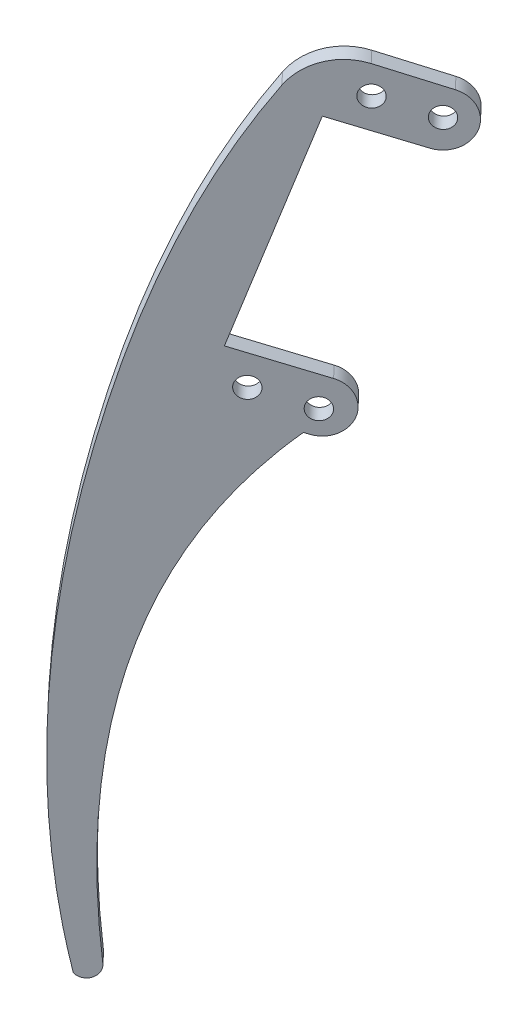
ISO-10303-21;
HEADER;
FILE_DESCRIPTION(('STEP AP214'),'2;1');
FILE_NAME('part.step','',(''),(''),'','','');
FILE_SCHEMA(('AUTOMOTIVE_DESIGN { 1 0 10303 214 1 1 1 1 }'));
ENDSEC;
DATA;
#1=APPLICATION_CONTEXT('core data for automotive mechanical design processes');
#2=APPLICATION_PROTOCOL_DEFINITION('international standard','automotive_design',2000,#1);
#3=PRODUCT_CONTEXT('',#1,'mechanical');
#4=PRODUCT('Part','Part','',(#3));
#5=PRODUCT_RELATED_PRODUCT_CATEGORY('part','',(#4));
#6=PRODUCT_DEFINITION_FORMATION('','',#4);
#7=PRODUCT_DEFINITION_CONTEXT('part definition',#1,'design');
#8=PRODUCT_DEFINITION('design','',#6,#7);
#9=PRODUCT_DEFINITION_SHAPE('','',#8);
#10=(LENGTH_UNIT() NAMED_UNIT(*) SI_UNIT(.MILLI.,.METRE.));
#11=(NAMED_UNIT(*) PLANE_ANGLE_UNIT() SI_UNIT($,.RADIAN.));
#12=(NAMED_UNIT(*) SI_UNIT($,.STERADIAN.) SOLID_ANGLE_UNIT());
#13=UNCERTAINTY_MEASURE_WITH_UNIT(LENGTH_MEASURE(1.E-05),#10,'distance_accuracy_value','');
#14=(GEOMETRIC_REPRESENTATION_CONTEXT(3) GLOBAL_UNCERTAINTY_ASSIGNED_CONTEXT((#13)) GLOBAL_UNIT_ASSIGNED_CONTEXT((#10,
#11,#12)) REPRESENTATION_CONTEXT('',''));
#15=CARTESIAN_POINT('',(0.,0.,0.));
#16=DIRECTION('',(0.,0.,1.));
#17=DIRECTION('',(1.,0.,0.));
#18=AXIS2_PLACEMENT_3D('',#15,#16,#17);
#19=CARTESIAN_POINT('',(-156.350347248188,53.1352398100801,110.507053501825));
#20=DIRECTION('',(-0.687588527999233,0.,-0.726100555132585));
#21=DIRECTION('',(-0.726100555132585,0.,0.687588527999233));
#22=AXIS2_PLACEMENT_3D('',#19,#20,#21);
#23=CYLINDRICAL_SURFACE('',#22,4.71761508586367);
#24=DIRECTION('',(0.687588527999233,0.,0.726100555132585));
#25=VECTOR('',#24,1.);
#26=CARTESIAN_POINT('',(-155.23061358615,57.5936879973342,109.446709979169));
#27=LINE('',#26,#25);
#28=CARTESIAN_POINT('',(-155.23061358615,57.5936879973342,109.446709979169));
#29=VERTEX_POINT('',#28);
#30=CARTESIAN_POINT('',(-157.293379170147,57.5936879973342,107.268408313772));
#31=VERTEX_POINT('',#30);
#32=EDGE_CURVE('E126',#29,#31,#27,.F.);
#33=ORIENTED_EDGE('',*,*,#32,.F.);
#34=CARTESIAN_POINT('',(-156.350347248188,53.1352398100801,110.507053501825));
#35=DIRECTION('',(-0.687588527999232,0.,-0.726100555132586));
#36=DIRECTION('',(-0.726100555132586,0.,0.687588527999232));
#37=AXIS2_PLACEMENT_3D('',#34,#35,#36);
#38=CIRCLE('',#37,4.71761508586367);
#39=CARTESIAN_POINT('',(-157.470080910226,48.6767916228261,111.567397024481));
#40=VERTEX_POINT('',#39);
#41=EDGE_CURVE('E47',#40,#29,#38,.F.);
#42=ORIENTED_EDGE('',*,*,#41,.F.);
#43=DIRECTION('',(-0.687588527999233,0.,-0.726100555132585));
#44=VECTOR('',#43,1.);
#45=CARTESIAN_POINT('',(-159.532846494223,48.6767916228261,109.389095359083));
#46=LINE('',#45,#44);
#47=CARTESIAN_POINT('',(-159.532846494223,48.6767916228261,109.389095359083));
#48=VERTEX_POINT('',#47);
#49=EDGE_CURVE('E269',#48,#40,#46,.F.);
#50=ORIENTED_EDGE('',*,*,#49,.F.);
#51=CARTESIAN_POINT('',(-158.413112832185,53.1352398100802,108.328751836427));
#52=DIRECTION('',(-0.687588527999232,0.,-0.726100555132586));
#53=DIRECTION('',(-0.726100555132586,0.,0.687588527999232));
#54=AXIS2_PLACEMENT_3D('',#51,#52,#53);
#55=CIRCLE('',#54,4.71761508586367);
#56=EDGE_CURVE('E12',#31,#48,#55,.T.);
#57=ORIENTED_EDGE('',*,*,#56,.F.);
#58=EDGE_LOOP('',(#33,#42,#50,#57));
#59=FACE_BOUND('',#58,.T.);
#60=ADVANCED_FACE('F39',(#59),#23,.T.);
#61=CARTESIAN_POINT('',(-145.004680858314,99.0307376649446,99.7631558459979));
#62=DIRECTION('',(0.687588527999233,0.,0.726100555132585));
#63=DIRECTION('',(0.726100555132585,0.,-0.687588527999233));
#64=AXIS2_PLACEMENT_3D('',#61,#62,#63);
#65=CYLINDRICAL_SURFACE('',#64,4.95310679918581);
#66=DIRECTION('',(0.687588527999233,0.,0.726100555132585));
#67=VECTOR('',#66,1.);
#68=CARTESIAN_POINT('',(-145.845721127589,103.689297249869,96.4279285938738));
#69=LINE('',#68,#67);
#70=CARTESIAN_POINT('',(-143.782955543592,103.689297249868,98.6062302592716));
#71=VERTEX_POINT('',#70);
#72=CARTESIAN_POINT('',(-145.845721127589,103.689297249869,96.4279285938738));
#73=VERTEX_POINT('',#72);
#74=EDGE_CURVE('E195',#71,#73,#69,.F.);
#75=ORIENTED_EDGE('',*,*,#74,.F.);
#76=CARTESIAN_POINT('',(-145.004680858314,99.0307376649446,99.7631558459979));
#77=DIRECTION('',(-0.687588527999232,0.,-0.726100555132586));
#78=DIRECTION('',(-0.726100555132586,0.,0.687588527999232));
#79=AXIS2_PLACEMENT_3D('',#76,#77,#78);
#80=CIRCLE('',#79,4.95310679918581);
#81=CARTESIAN_POINT('',(-146.180308863942,94.3497347369444,100.876429102919));
#82=VERTEX_POINT('',#81);
#83=EDGE_CURVE('E198',#82,#71,#80,.F.);
#84=ORIENTED_EDGE('',*,*,#83,.F.);
#85=DIRECTION('',(-0.687588527999233,0.,-0.726100555132585));
#86=VECTOR('',#85,1.);
#87=CARTESIAN_POINT('',(-146.180308863942,94.3497347369444,100.876429102919));
#88=LINE('',#87,#86);
#89=CARTESIAN_POINT('',(-148.24307444794,94.3497347369444,98.6981274375217));
#90=VERTEX_POINT('',#89);
#91=EDGE_CURVE('E202',#90,#82,#88,.F.);
#92=ORIENTED_EDGE('',*,*,#91,.F.);
#93=CARTESIAN_POINT('',(-147.067446442311,99.0307376649446,97.5848541806001));
#94=DIRECTION('',(-0.687588527999232,0.,-0.726100555132586));
#95=DIRECTION('',(-0.726100555132586,0.,0.687588527999232));
#96=AXIS2_PLACEMENT_3D('',#93,#94,#95);
#97=CIRCLE('',#96,4.95310679918581);
#98=EDGE_CURVE('E200',#73,#90,#97,.T.);
#99=ORIENTED_EDGE('',*,*,#98,.F.);
#100=EDGE_LOOP('',(#75,#84,#92,#99));
#101=FACE_BOUND('',#100,.T.);
#102=ADVANCED_FACE('F183',(#101),#65,.T.);
#103=CARTESIAN_POINT('',(-154.162654944035,98.2201573974446,108.435395354073));
#104=DIRECTION('',(0.687588527999233,0.,0.726100555132585));
#105=DIRECTION('',(0.726100555132585,0.,-0.687588527999233));
#106=AXIS2_PLACEMENT_3D('',#103,#104,#105);
#107=CYLINDRICAL_SURFACE('',#106,10.);
#108=DIRECTION('',(0.687588527999233,0.,0.726100555132585));
#109=VECTOR('',#108,1.);
#110=CARTESIAN_POINT('',(-160.093495987517,103.989265875256,114.051667417301));
#111=LINE('',#110,#109);
#112=CARTESIAN_POINT('',(-160.093495987518,103.989265875255,114.051667417302));
#113=VERTEX_POINT('',#112);
#114=CARTESIAN_POINT('',(-162.156261571515,103.989265875256,111.873365751904));
#115=VERTEX_POINT('',#114);
#116=EDGE_CURVE('E241',#113,#115,#111,.F.);
#117=ORIENTED_EDGE('',*,*,#116,.F.);
#118=CARTESIAN_POINT('',(-154.162654944035,98.2201573974446,108.435395354073));
#119=DIRECTION('',(-0.687588527999232,0.,-0.726100555132586));
#120=DIRECTION('',(-0.726100555132586,0.,0.687588527999232));
#121=AXIS2_PLACEMENT_3D('',#118,#119,#120);
#122=CIRCLE('',#121,10.);
#123=CARTESIAN_POINT('',(-151.696071112403,107.625485757596,106.099637952443));
#124=VERTEX_POINT('',#123);
#125=EDGE_CURVE('E261',#124,#113,#122,.F.);
#126=ORIENTED_EDGE('',*,*,#125,.F.);
#127=DIRECTION('',(0.687588527999233,0.,0.726100555132585));
#128=VECTOR('',#127,1.);
#129=CARTESIAN_POINT('',(-153.7588366964,107.625485757596,103.921336287045));
#130=LINE('',#129,#128);
#131=CARTESIAN_POINT('',(-153.7588366964,107.625485757596,103.921336287045));
#132=VERTEX_POINT('',#131);
#133=EDGE_CURVE('E208',#132,#124,#130,.T.);
#134=ORIENTED_EDGE('',*,*,#133,.F.);
#135=CARTESIAN_POINT('',(-156.225420528033,98.2201573974446,106.257093688676));
#136=DIRECTION('',(-0.687588527999232,0.,-0.726100555132586));
#137=DIRECTION('',(-0.726100555132586,0.,0.687588527999232));
#138=AXIS2_PLACEMENT_3D('',#135,#136,#137);
#139=CIRCLE('',#138,10.);
#140=EDGE_CURVE('E203',#115,#132,#139,.T.);
#141=ORIENTED_EDGE('',*,*,#140,.F.);
#142=EDGE_LOOP('',(#117,#126,#134,#141));
#143=FACE_BOUND('',#142,.T.);
#144=ADVANCED_FACE('F181',(#143),#107,.T.);
#145=CARTESIAN_POINT('',(-178.91344157564,39.3494428640082,131.873412067531));
#146=DIRECTION('',(-0.687588527999232,0.,-0.726100555132586));
#147=DIRECTION('',(-0.726100555132586,0.,0.687588527999232));
#148=AXIS2_PLACEMENT_3D('',#145,#146,#147);
#149=PLANE('',#148);
#150=CARTESIAN_POINT('',(-151.666537072057,102.459409082074,106.071670383512));
#151=DIRECTION('',(0.687588527999233,0.,0.726100555132585));
#152=DIRECTION('',(0.726100555132585,0.,-0.687588527999233));
#153=AXIS2_PLACEMENT_3D('',#150,#151,#152);
#154=CIRCLE('',#153,1.90499999999996);
#155=CARTESIAN_POINT('',(-150.28331551453,102.459409082074,104.761814237674));
#156=VERTEX_POINT('',#155);
#157=EDGE_CURVE('E257',#156,#156,#154,.T.);
#158=ORIENTED_EDGE('',*,*,#157,.F.);
#159=EDGE_LOOP('',(#158));
#160=FACE_BOUND('',#159,.T.);
#161=CARTESIAN_POINT('',(-144.938645084473,99.2544943211719,99.7006225781071));
#162=DIRECTION('',(0.687588527999233,0.,0.726100555132585));
#163=DIRECTION('',(0.726100555132585,0.,-0.687588527999233));
#164=AXIS2_PLACEMENT_3D('',#161,#162,#163);
#165=CIRCLE('',#164,1.90499999999996);
#166=CARTESIAN_POINT('',(-143.555423526946,99.2544943211719,98.3907664322686));
#167=VERTEX_POINT('',#166);
#168=EDGE_CURVE('E245',#167,#167,#165,.T.);
#169=ORIENTED_EDGE('',*,*,#168,.F.);
#170=EDGE_LOOP('',(#169));
#171=FACE_BOUND('',#170,.T.);
#172=DIRECTION('',(0.686211495612596,-0.326885353606716,-0.649815165171247));
#173=VECTOR('',#172,1.);
#174=CARTESIAN_POINT('',(-158.068027168026,48.9616307360856,112.133628497956));
#175=LINE('',#174,#173);
#176=CARTESIAN_POINT('',(-158.068027168026,48.9616307360856,112.133628497956));
#177=VERTEX_POINT('',#176);
#178=EDGE_CURVE('E145',#177,#40,#175,.T.);
#179=ORIENTED_EDGE('',*,*,#178,.T.);
#180=ORIENTED_EDGE('',*,*,#41,.T.);
#181=DIRECTION('',(-0.686211495612596,0.326885353606716,0.649815165171248));
#182=VECTOR('',#181,1.);
#183=CARTESIAN_POINT('',(-172.290423852449,65.7203401257488,125.601676045555));
#184=LINE('',#183,#182);
#185=CARTESIAN_POINT('',(-165.501405173451,62.4863069075413,119.172743679294));
#186=VERTEX_POINT('',#185);
#187=EDGE_CURVE('E229',#29,#186,#184,.T.);
#188=ORIENTED_EDGE('',*,*,#187,.T.);
#189=DIRECTION('',(0.237351636718549,0.945064000794344,-0.224762619110949));
#190=VECTOR('',#189,1.);
#191=CARTESIAN_POINT('',(-172.124422896642,36.1154096458007,125.44447970127));
#192=LINE('',#191,#190);
#193=CARTESIAN_POINT('',(-156.28950333044,99.1653748551708,110.449436716455));
#194=VERTEX_POINT('',#193);
#195=EDGE_CURVE('E137',#186,#194,#192,.T.);
#196=ORIENTED_EDGE('',*,*,#195,.T.);
#197=DIRECTION('',(0.686211495612595,-0.326885353606717,-0.649815165171248));
#198=VECTOR('',#197,1.);
#199=CARTESIAN_POINT('',(-163.078522009438,102.399408073378,116.878369082716));
#200=LINE('',#199,#198);
#201=EDGE_CURVE('E238',#194,#82,#200,.T.);
#202=ORIENTED_EDGE('',*,*,#201,.T.);
#203=ORIENTED_EDGE('',*,*,#83,.T.);
#204=DIRECTION('',(-0.682921414350983,0.339702788297954,0.646699588250564));
#205=VECTOR('',#204,1.);
#206=CARTESIAN_POINT('',(-140.446048893136,102.029433509138,95.4463115460309));
#207=LINE('',#206,#205);
#208=EDGE_CURVE('E206',#71,#124,#207,.T.);
#209=ORIENTED_EDGE('',*,*,#208,.T.);
#210=ORIENTED_EDGE('',*,*,#125,.T.);
#211=CARTESIAN_POINT('',(-156.706471761986,110.117788730375,110.844289341264));
#212=CARTESIAN_POINT('',(-165.389464605852,95.5567781375464,119.066740386012));
#213=CARTESIAN_POINT('',(-171.354325872558,77.203961524337,124.715228256049));
#214=CARTESIAN_POINT('',(-182.015512379828,27.9424777058261,134.810950515785));
#215=CARTESIAN_POINT('',(-184.5509725595,-5.55144568956583,137.211931096806));
#216=CARTESIAN_POINT('',(-179.709395746549,-37.3051271876202,132.627149208841));
#217=B_SPLINE_CURVE_WITH_KNOTS('',3,(#211,#212,#213,#214,#215,#216),.UNSPECIFIED.,.F.,.F.,(4,2,
4),(0.20816836898779,0.5,1.),.UNSPECIFIED.);
#218=CARTESIAN_POINT('',(-179.709395746549,-37.3051271876202,132.627149208841));
#219=VERTEX_POINT('',#218);
#220=EDGE_CURVE('E211',#113,#219,#217,.T.);
#221=ORIENTED_EDGE('',*,*,#220,.T.);
#222=CARTESIAN_POINT('',(-178.494266452893,-35.9408966491913,131.47646979337));
#223=DIRECTION('',(0.687588527999233,0.,0.726100555132585));
#224=DIRECTION('',(0.726100555132585,0.,-0.687588527999233));
#225=AXIS2_PLACEMENT_3D('',#222,#223,#224);
#226=CIRCLE('',#225,2.15910335080896);
#227=CARTESIAN_POINT('',(-176.930693083653,-35.7838478574372,129.995827609894));
#228=VERTEX_POINT('',#227);
#229=EDGE_CURVE('E213',#219,#228,#226,.T.);
#230=ORIENTED_EDGE('',*,*,#229,.T.);
#231=CARTESIAN_POINT('',(586.336011271694,-821.148347771269,-592.787574783582));
#232=DIRECTION('',(-0.687588527999233,0.,-0.726100555132585));
#233=DIRECTION('',(0.557424393382231,-0.640814372215929,-0.527858869418671));
#234=AXIS2_PLACEMENT_3D('',#231,#232,#233);
#235=ELLIPSE('',#234,1345.47017903195,311.067485079547);
#236=EDGE_CURVE('E151',#228,#177,#235,.T.);
#237=ORIENTED_EDGE('',*,*,#236,.T.);
#238=EDGE_LOOP('',(#179,#180,#188,#196,#202,#203,#209,#210,#221,#230,#237));
#239=FACE_BOUND('',#238,.T.);
#240=CARTESIAN_POINT('',(-156.616298140698,52.7575344948903,110.758898485842));
#241=DIRECTION('',(0.687588527999233,0.,0.726100555132585));
#242=DIRECTION('',(0.726100555132585,0.,-0.687588527999233));
#243=AXIS2_PLACEMENT_3D('',#240,#241,#242);
#244=CIRCLE('',#243,1.90499999999997);
#245=CARTESIAN_POINT('',(-155.233076583171,52.7575344948903,109.449042340003));
#246=VERTEX_POINT('',#245);
#247=EDGE_CURVE('E249',#246,#246,#244,.T.);
#248=ORIENTED_EDGE('',*,*,#247,.F.);
#249=EDGE_LOOP('',(#248));
#250=FACE_BOUND('',#249,.T.);
#251=CARTESIAN_POINT('',(-163.344190128283,55.962449255792,117.129946291247));
#252=DIRECTION('',(0.687588527999233,0.,0.726100555132585));
#253=DIRECTION('',(0.726100555132585,0.,-0.687588527999233));
#254=AXIS2_PLACEMENT_3D('',#251,#252,#253);
#255=CIRCLE('',#254,1.90499999999997);
#256=CARTESIAN_POINT('',(-161.960968570755,55.962449255792,115.820090145408));
#257=VERTEX_POINT('',#256);
#258=EDGE_CURVE('E253',#257,#257,#255,.T.);
#259=ORIENTED_EDGE('',*,*,#258,.F.);
#260=EDGE_LOOP('',(#259));
#261=FACE_BOUND('',#260,.T.);
#262=ADVANCED_FACE('F179',(#160,#171,#239,#250,#261),#149,.F.);
#263=CARTESIAN_POINT('',(-160.130792752023,48.9616307360856,109.955326832558));
#264=DIRECTION('',(-0.237351636718549,-0.945064000794344,0.224762619110949));
#265=DIRECTION('',(0.969879782026592,-0.243584089004292,0.));
#266=AXIS2_PLACEMENT_3D('',#263,#264,#265);
#267=PLANE('',#266);
#268=DIRECTION('',(0.686211495612596,-0.326885353606716,-0.649815165171247));
#269=VECTOR('',#268,1.);
#270=CARTESIAN_POINT('',(-160.130792752023,48.9616307360856,109.955326832558));
#271=LINE('',#270,#269);
#272=CARTESIAN_POINT('',(-160.130792752023,48.9616307360856,109.955326832558));
#273=VERTEX_POINT('',#272);
#274=EDGE_CURVE('E147',#273,#48,#271,.T.);
#275=ORIENTED_EDGE('',*,*,#274,.T.);
#276=ORIENTED_EDGE('',*,*,#49,.T.);
#277=ORIENTED_EDGE('',*,*,#178,.F.);
#278=DIRECTION('',(0.687588527999233,0.,0.726100555132585));
#279=VECTOR('',#278,1.);
#280=CARTESIAN_POINT('',(-160.130792752023,48.9616307360856,109.955326832558));
#281=LINE('',#280,#279);
#282=EDGE_CURVE('E227',#273,#177,#281,.T.);
#283=ORIENTED_EDGE('',*,*,#282,.F.);
#284=EDGE_LOOP('',(#275,#276,#277,#283));
#285=FACE_BOUND('',#284,.T.);
#286=ADVANCED_FACE('F175',(#285),#267,.T.);
#287=CARTESIAN_POINT('',(584.273245687696,-821.148347771269,-594.965876448979));
#288=DIRECTION('',(-0.687588527999233,0.,-0.726100555132585));
#289=DIRECTION('',(0.557424393382231,-0.640814372215929,-0.527858869418671));
#290=AXIS2_PLACEMENT_3D('',#287,#288,#289);
#291=ELLIPSE('',#290,1345.47017903195,311.067485079547);
#292=DIRECTION('',(0.687588527999233,0.,0.726100555132585));
#293=VECTOR('',#292,1.);
#294=SURFACE_OF_LINEAR_EXTRUSION('',#291,#293);
#295=ORIENTED_EDGE('',*,*,#236,.F.);
#296=DIRECTION('',(0.687588527999233,0.,0.726100555132585));
#297=VECTOR('',#296,1.);
#298=CARTESIAN_POINT('',(-178.993458667651,-35.7838478574371,127.817525944496));
#299=LINE('',#298,#297);
#300=CARTESIAN_POINT('',(-178.993458667651,-35.7838478574371,127.817525944496));
#301=VERTEX_POINT('',#300);
#302=EDGE_CURVE('E230',#301,#228,#299,.T.);
#303=ORIENTED_EDGE('',*,*,#302,.F.);
#304=EDGE_CURVE('E235',#301,#273,#291,.T.);
#305=ORIENTED_EDGE('',*,*,#304,.T.);
#306=ORIENTED_EDGE('',*,*,#282,.T.);
#307=EDGE_LOOP('',(#295,#303,#305,#306));
#308=FACE_BOUND('',#307,.T.);
#309=ADVANCED_FACE('F178',(#308),#294,.T.);
#310=CARTESIAN_POINT('',(-180.55703203689,-35.9408966491913,129.298168127972));
#311=DIRECTION('',(0.687588527999233,0.,0.726100555132585));
#312=DIRECTION('',(0.726100555132585,0.,-0.687588527999233));
#313=AXIS2_PLACEMENT_3D('',#310,#311,#312);
#314=CYLINDRICAL_SURFACE('',#313,2.15910335080896);
#315=ORIENTED_EDGE('',*,*,#229,.F.);
#316=DIRECTION('',(0.687588527999233,0.,0.726100555132585));
#317=VECTOR('',#316,1.);
#318=CARTESIAN_POINT('',(-181.772161330546,-37.3051271876202,130.448847543444));
#319=LINE('',#318,#317);
#320=CARTESIAN_POINT('',(-181.772161330546,-37.3051271876202,130.448847543444));
#321=VERTEX_POINT('',#320);
#322=EDGE_CURVE('E232',#321,#219,#319,.T.);
#323=ORIENTED_EDGE('',*,*,#322,.F.);
#324=CARTESIAN_POINT('',(-180.55703203689,-35.9408966491913,129.298168127972));
#325=DIRECTION('',(0.687588527999233,0.,0.726100555132585));
#326=DIRECTION('',(0.726100555132585,0.,-0.687588527999233));
#327=AXIS2_PLACEMENT_3D('',#324,#325,#326);
#328=CIRCLE('',#327,2.15910335080896);
#329=EDGE_CURVE('E158',#321,#301,#328,.T.);
#330=ORIENTED_EDGE('',*,*,#329,.T.);
#331=ORIENTED_EDGE('',*,*,#302,.T.);
#332=EDGE_LOOP('',(#315,#323,#330,#331));
#333=FACE_BOUND('',#332,.T.);
#334=ADVANCED_FACE('F169',(#333),#314,.T.);
#335=CARTESIAN_POINT('',(-158.769237345984,110.117788730375,108.665987675866));
#336=CARTESIAN_POINT('',(-167.45223018985,95.5567781375464,116.888438720614));
#337=CARTESIAN_POINT('',(-173.417091456555,77.2039615243371,122.536926590651));
#338=CARTESIAN_POINT('',(-184.078277963825,27.9424777058261,132.632648850387));
#339=CARTESIAN_POINT('',(-186.613738143498,-5.55144568956582,135.033629431408));
#340=CARTESIAN_POINT('',(-181.772161330546,-37.3051271876202,130.448847543444));
#341=B_SPLINE_CURVE_WITH_KNOTS('',3,(#335,#336,#337,#338,#339,#340),.UNSPECIFIED.,.F.,.F.,(4,2,
4),(0.20816836898779,0.5,1.),.UNSPECIFIED.);
#342=DIRECTION('',(0.687588527999233,0.,0.726100555132585));
#343=VECTOR('',#342,1.);
#344=SURFACE_OF_LINEAR_EXTRUSION('',#341,#343);
#345=ORIENTED_EDGE('',*,*,#220,.F.);
#346=ORIENTED_EDGE('',*,*,#116,.T.);
#347=EDGE_CURVE('E153',#115,#321,#341,.T.);
#348=ORIENTED_EDGE('',*,*,#347,.T.);
#349=ORIENTED_EDGE('',*,*,#322,.T.);
#350=EDGE_LOOP('',(#345,#346,#348,#349));
#351=FACE_BOUND('',#350,.T.);
#352=ADVANCED_FACE('F164',(#351),#344,.T.);
#353=CARTESIAN_POINT('',(-142.508814477133,102.029433509138,93.2680098806331));
#354=DIRECTION('',(0.246658383163233,0.940532836015094,-0.233575740163024));
#355=DIRECTION('',(-0.967289404935484,0.253675397111264,0.));
#356=AXIS2_PLACEMENT_3D('',#353,#354,#355);
#357=PLANE('',#356);
#358=ORIENTED_EDGE('',*,*,#208,.F.);
#359=ORIENTED_EDGE('',*,*,#74,.T.);
#360=DIRECTION('',(-0.682921414350983,0.339702788297954,0.646699588250564));
#361=VECTOR('',#360,1.);
#362=CARTESIAN_POINT('',(-142.508814477133,102.029433509138,93.2680098806331));
#363=LINE('',#362,#361);
#364=EDGE_CURVE('E150',#73,#132,#363,.T.);
#365=ORIENTED_EDGE('',*,*,#364,.T.);
#366=ORIENTED_EDGE('',*,*,#133,.T.);
#367=EDGE_LOOP('',(#358,#359,#365,#366));
#368=FACE_BOUND('',#367,.T.);
#369=ADVANCED_FACE('F168',(#368),#357,.T.);
#370=CARTESIAN_POINT('',(-180.976207159638,39.3494428640082,129.695110402133));
#371=DIRECTION('',(-0.687588527999232,0.,-0.726100555132586));
#372=DIRECTION('',(-0.726100555132586,0.,0.687588527999232));
#373=AXIS2_PLACEMENT_3D('',#370,#371,#372);
#374=PLANE('',#373);
#375=CARTESIAN_POINT('',(-153.729302656055,102.459409082074,103.893368718114));
#376=DIRECTION('',(-0.687588527999232,0.,-0.726100555132586));
#377=DIRECTION('',(-0.726100555132586,0.,0.687588527999232));
#378=AXIS2_PLACEMENT_3D('',#375,#376,#377);
#379=CIRCLE('',#378,1.90499999999997);
#380=CARTESIAN_POINT('',(-155.112524213583,102.459409082074,105.203224863953));
#381=VERTEX_POINT('',#380);
#382=EDGE_CURVE('E254',#381,#381,#379,.T.);
#383=ORIENTED_EDGE('',*,*,#382,.F.);
#384=EDGE_LOOP('',(#383));
#385=FACE_BOUND('',#384,.T.);
#386=CARTESIAN_POINT('',(-165.406955712281,55.962449255792,114.951644625849));
#387=DIRECTION('',(-0.687588527999232,0.,-0.726100555132586));
#388=DIRECTION('',(-0.726100555132586,0.,0.687588527999232));
#389=AXIS2_PLACEMENT_3D('',#386,#387,#388);
#390=CIRCLE('',#389,1.90499999999997);
#391=CARTESIAN_POINT('',(-166.790177269808,55.962449255792,116.261500771687));
#392=VERTEX_POINT('',#391);
#393=EDGE_CURVE('E250',#392,#392,#390,.T.);
#394=ORIENTED_EDGE('',*,*,#393,.F.);
#395=EDGE_LOOP('',(#394));
#396=FACE_BOUND('',#395,.T.);
#397=CARTESIAN_POINT('',(-158.679063724696,52.7575344948903,108.580596820444));
#398=DIRECTION('',(-0.687588527999232,0.,-0.726100555132586));
#399=DIRECTION('',(-0.726100555132586,0.,0.687588527999232));
#400=AXIS2_PLACEMENT_3D('',#397,#398,#399);
#401=CIRCLE('',#400,1.90499999999997);
#402=CARTESIAN_POINT('',(-160.062285282224,52.7575344948903,109.890452966282));
#403=VERTEX_POINT('',#402);
#404=EDGE_CURVE('E246',#403,#403,#401,.T.);
#405=ORIENTED_EDGE('',*,*,#404,.F.);
#406=EDGE_LOOP('',(#405));
#407=FACE_BOUND('',#406,.T.);
#408=CARTESIAN_POINT('',(-147.001410668471,99.2544943211719,97.522320912709));
#409=DIRECTION('',(-0.687588527999232,0.,-0.726100555132586));
#410=DIRECTION('',(-0.726100555132586,0.,0.687588527999232));
#411=AXIS2_PLACEMENT_3D('',#408,#409,#410);
#412=CIRCLE('',#411,1.90499999999997);
#413=CARTESIAN_POINT('',(-148.384632225999,99.2544943211719,98.8321770585475));
#414=VERTEX_POINT('',#413);
#415=EDGE_CURVE('E242',#414,#414,#412,.T.);
#416=ORIENTED_EDGE('',*,*,#415,.F.);
#417=EDGE_LOOP('',(#416));
#418=FACE_BOUND('',#417,.T.);
#419=DIRECTION('',(-0.686211495612595,0.326885353606716,0.649815165171249));
#420=VECTOR('',#419,1.);
#421=CARTESIAN_POINT('',(-154.056097466314,56.0515687217931,104.202830487501));
#422=LINE('',#421,#420);
#423=CARTESIAN_POINT('',(-167.564170757448,62.4863069075413,116.994442013897));
#424=VERTEX_POINT('',#423);
#425=EDGE_CURVE('E120',#31,#424,#422,.T.);
#426=ORIENTED_EDGE('',*,*,#425,.F.);
#427=ORIENTED_EDGE('',*,*,#56,.T.);
#428=ORIENTED_EDGE('',*,*,#274,.F.);
#429=ORIENTED_EDGE('',*,*,#304,.F.);
#430=ORIENTED_EDGE('',*,*,#329,.F.);
#431=ORIENTED_EDGE('',*,*,#347,.F.);
#432=ORIENTED_EDGE('',*,*,#140,.T.);
#433=ORIENTED_EDGE('',*,*,#364,.F.);
#434=ORIENTED_EDGE('',*,*,#98,.T.);
#435=DIRECTION('',(0.686211495612594,-0.326885353606717,-0.649815165171249));
#436=VECTOR('',#435,1.);
#437=CARTESIAN_POINT('',(-158.352268914437,99.1653748551708,108.271135051058));
#438=LINE('',#437,#436);
#439=CARTESIAN_POINT('',(-158.352268914437,99.1653748551708,108.271135051058));
#440=VERTEX_POINT('',#439);
#441=EDGE_CURVE('E129',#440,#90,#438,.T.);
#442=ORIENTED_EDGE('',*,*,#441,.F.);
#443=DIRECTION('',(0.237351636718549,0.945064000794344,-0.224762619110949));
#444=VECTOR('',#443,1.);
#445=CARTESIAN_POINT('',(-167.564170757448,62.4863069075413,116.994442013897));
#446=LINE('',#445,#444);
#447=EDGE_CURVE('E128',#424,#440,#446,.T.);
#448=ORIENTED_EDGE('',*,*,#447,.F.);
#449=EDGE_LOOP('',(#426,#427,#428,#429,#430,#431,#432,#433,#434,#442,#448));
#450=FACE_BOUND('',#449,.T.);
#451=ADVANCED_FACE('F140',(#385,#396,#407,#418,#450),#374,.T.);
#452=CARTESIAN_POINT('',(-135.437666442208,99.1653748551707,132.469190862347));
#453=DIRECTION('',(0.23735163671855,0.945064000794344,-0.22476261911095));
#454=DIRECTION('',(-0.969879782026592,0.243584089004292,0.));
#455=AXIS2_PLACEMENT_3D('',#452,#453,#454);
#456=PLANE('',#455);
#457=ORIENTED_EDGE('',*,*,#441,.T.);
#458=ORIENTED_EDGE('',*,*,#91,.T.);
#459=ORIENTED_EDGE('',*,*,#201,.F.);
#460=DIRECTION('',(-0.687588527999233,0.,-0.726100555132585));
#461=VECTOR('',#460,1.);
#462=CARTESIAN_POINT('',(-135.437666442208,99.1653748551707,132.469190862347));
#463=LINE('',#462,#461);
#464=EDGE_CURVE('E138',#194,#440,#463,.T.);
#465=ORIENTED_EDGE('',*,*,#464,.T.);
#466=EDGE_LOOP('',(#457,#458,#459,#465));
#467=FACE_BOUND('',#466,.T.);
#468=ADVANCED_FACE('F286',(#467),#456,.F.);
#469=CARTESIAN_POINT('',(-144.649568285219,62.4863069075413,141.192497825186));
#470=DIRECTION('',(-0.686211495612594,0.326885353606716,0.64981516517125));
#471=DIRECTION('',(0.687588527999234,0.,0.726100555132584));
#472=AXIS2_PLACEMENT_3D('',#469,#470,#471);
#473=PLANE('',#472);
#474=DIRECTION('',(-0.687588527999233,0.,-0.726100555132585));
#475=VECTOR('',#474,1.);
#476=CARTESIAN_POINT('',(-144.649568285219,62.4863069075413,141.192497825186));
#477=LINE('',#476,#475);
#478=EDGE_CURVE('E124',#186,#424,#477,.T.);
#479=ORIENTED_EDGE('',*,*,#478,.T.);
#480=ORIENTED_EDGE('',*,*,#447,.T.);
#481=ORIENTED_EDGE('',*,*,#464,.F.);
#482=ORIENTED_EDGE('',*,*,#195,.F.);
#483=EDGE_LOOP('',(#479,#480,#481,#482));
#484=FACE_BOUND('',#483,.T.);
#485=ADVANCED_FACE('F133',(#484),#473,.F.);
#486=CARTESIAN_POINT('',(-131.141494994085,56.0515687217931,128.40088629879));
#487=DIRECTION('',(-0.237351636718549,-0.945064000794344,0.224762619110949));
#488=DIRECTION('',(0.969879782026592,-0.243584089004292,0.));
#489=AXIS2_PLACEMENT_3D('',#486,#487,#488);
#490=PLANE('',#489);
#491=ORIENTED_EDGE('',*,*,#187,.F.);
#492=ORIENTED_EDGE('',*,*,#32,.T.);
#493=ORIENTED_EDGE('',*,*,#425,.T.);
#494=ORIENTED_EDGE('',*,*,#478,.F.);
#495=EDGE_LOOP('',(#491,#492,#493,#494));
#496=FACE_BOUND('',#495,.T.);
#497=ADVANCED_FACE('F123',(#496),#490,.F.);
#498=CARTESIAN_POINT('',(-144.938645084473,99.2544943211719,99.7006225781071));
#499=DIRECTION('',(0.687588527999233,0.,0.726100555132585));
#500=DIRECTION('',(0.726100555132585,0.,-0.687588527999233));
#501=AXIS2_PLACEMENT_3D('',#498,#499,#500);
#502=CYLINDRICAL_SURFACE('',#501,1.90499999999997);
#503=ORIENTED_EDGE('',*,*,#415,.T.);
#504=EDGE_LOOP('',(#503));
#505=FACE_BOUND('',#504,.T.);
#506=ORIENTED_EDGE('',*,*,#168,.T.);
#507=EDGE_LOOP('',(#506));
#508=FACE_BOUND('',#507,.T.);
#509=ADVANCED_FACE('F293',(#505,#508),#502,.F.);
#510=CARTESIAN_POINT('',(-156.616298140698,52.7575344948903,110.758898485842));
#511=DIRECTION('',(0.687588527999233,0.,0.726100555132585));
#512=DIRECTION('',(0.726100555132585,0.,-0.687588527999233));
#513=AXIS2_PLACEMENT_3D('',#510,#511,#512);
#514=CYLINDRICAL_SURFACE('',#513,1.90499999999997);
#515=ORIENTED_EDGE('',*,*,#404,.T.);
#516=EDGE_LOOP('',(#515));
#517=FACE_BOUND('',#516,.T.);
#518=ORIENTED_EDGE('',*,*,#247,.T.);
#519=EDGE_LOOP('',(#518));
#520=FACE_BOUND('',#519,.T.);
#521=ADVANCED_FACE('F298',(#517,#520),#514,.F.);
#522=CARTESIAN_POINT('',(-163.344190128283,55.962449255792,117.129946291247));
#523=DIRECTION('',(0.687588527999233,0.,0.726100555132585));
#524=DIRECTION('',(0.726100555132585,0.,-0.687588527999233));
#525=AXIS2_PLACEMENT_3D('',#522,#523,#524);
#526=CYLINDRICAL_SURFACE('',#525,1.90499999999997);
#527=ORIENTED_EDGE('',*,*,#393,.T.);
#528=EDGE_LOOP('',(#527));
#529=FACE_BOUND('',#528,.T.);
#530=ORIENTED_EDGE('',*,*,#258,.T.);
#531=EDGE_LOOP('',(#530));
#532=FACE_BOUND('',#531,.T.);
#533=ADVANCED_FACE('F302',(#529,#532),#526,.F.);
#534=CARTESIAN_POINT('',(-151.666537072057,102.459409082074,106.071670383512));
#535=DIRECTION('',(0.687588527999233,0.,0.726100555132585));
#536=DIRECTION('',(0.726100555132585,0.,-0.687588527999233));
#537=AXIS2_PLACEMENT_3D('',#534,#535,#536);
#538=CYLINDRICAL_SURFACE('',#537,1.90499999999997);
#539=ORIENTED_EDGE('',*,*,#382,.T.);
#540=EDGE_LOOP('',(#539));
#541=FACE_BOUND('',#540,.T.);
#542=ORIENTED_EDGE('',*,*,#157,.T.);
#543=EDGE_LOOP('',(#542));
#544=FACE_BOUND('',#543,.T.);
#545=ADVANCED_FACE('F306',(#541,#544),#538,.F.);
#546=CLOSED_SHELL('',(#60,#102,#144,#262,#286,#309,#334,#352,#369,#451,#468,#485,#497,#509,#521,
#533,#545));
#547=MANIFOLD_SOLID_BREP('B2',#546);
#548=ADVANCED_BREP_SHAPE_REPRESENTATION('',(#18,#547),#14);
#549=SHAPE_DEFINITION_REPRESENTATION(#9,#548);
ENDSEC;
END-ISO-10303-21;
